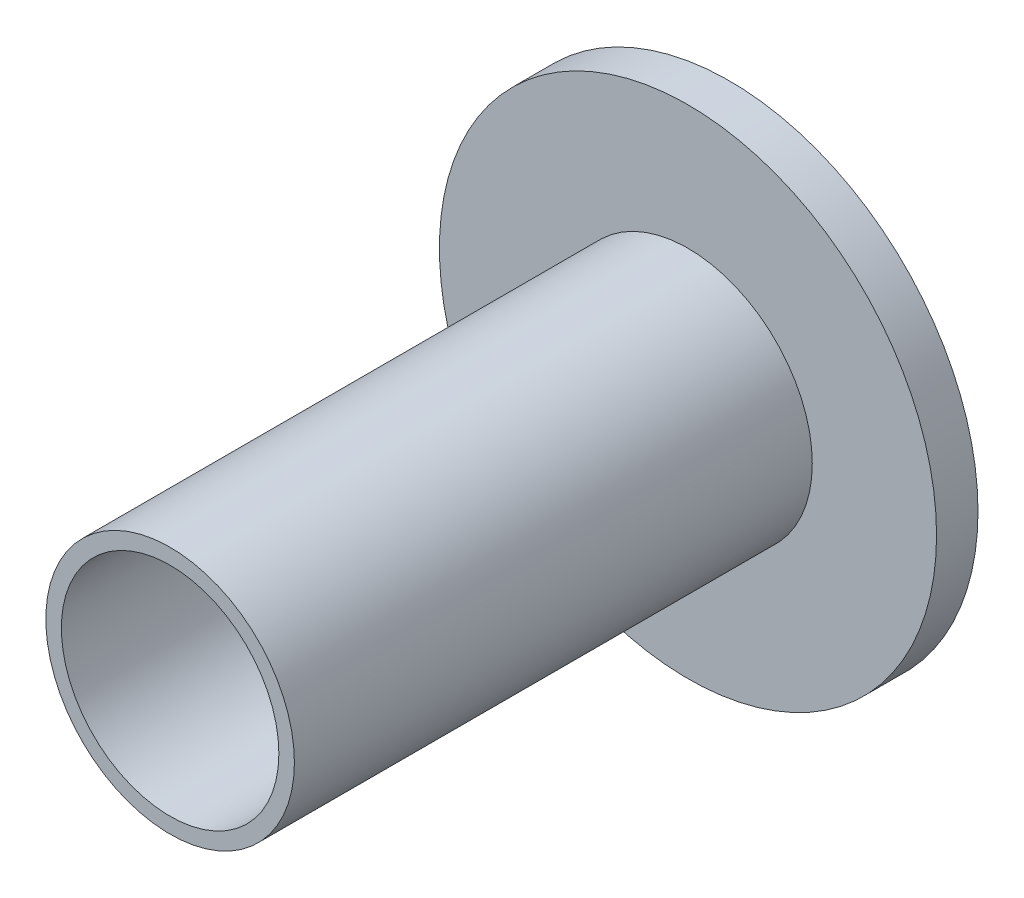
ISO-10303-21;
HEADER;
FILE_DESCRIPTION(('STEP AP214'),'2;1');
FILE_NAME('part.step','',(''),(''),'','','');
FILE_SCHEMA(('AUTOMOTIVE_DESIGN { 1 0 10303 214 1 1 1 1 }'));
ENDSEC;
DATA;
#1=APPLICATION_CONTEXT('core data for automotive mechanical design processes');
#2=APPLICATION_PROTOCOL_DEFINITION('international standard','automotive_design',2000,#1);
#3=PRODUCT_CONTEXT('',#1,'mechanical');
#4=PRODUCT('Part','Part','',(#3));
#5=PRODUCT_RELATED_PRODUCT_CATEGORY('part','',(#4));
#6=PRODUCT_DEFINITION_FORMATION('','',#4);
#7=PRODUCT_DEFINITION_CONTEXT('part definition',#1,'design');
#8=PRODUCT_DEFINITION('design','',#6,#7);
#9=PRODUCT_DEFINITION_SHAPE('','',#8);
#10=(LENGTH_UNIT() NAMED_UNIT(*) SI_UNIT(.MILLI.,.METRE.));
#11=(NAMED_UNIT(*) PLANE_ANGLE_UNIT() SI_UNIT($,.RADIAN.));
#12=(NAMED_UNIT(*) SI_UNIT($,.STERADIAN.) SOLID_ANGLE_UNIT());
#13=UNCERTAINTY_MEASURE_WITH_UNIT(LENGTH_MEASURE(1.E-05),#10,'distance_accuracy_value','');
#14=(GEOMETRIC_REPRESENTATION_CONTEXT(3) GLOBAL_UNCERTAINTY_ASSIGNED_CONTEXT((#13)) GLOBAL_UNIT_ASSIGNED_CONTEXT((#10,
#11,#12)) REPRESENTATION_CONTEXT('',''));
#15=CARTESIAN_POINT('',(0.,0.,0.));
#16=DIRECTION('',(0.,0.,1.));
#17=DIRECTION('',(1.,0.,0.));
#18=AXIS2_PLACEMENT_3D('',#15,#16,#17);
#19=CARTESIAN_POINT('',(0.,0.,2.));
#20=DIRECTION('',(0.,0.,-1.));
#21=DIRECTION('',(-1.,0.,0.));
#22=AXIS2_PLACEMENT_3D('',#19,#20,#21);
#23=CYLINDRICAL_SURFACE('',#22,12.);
#24=CARTESIAN_POINT('',(0.,0.,2.));
#25=DIRECTION('',(0.,0.,1.));
#26=DIRECTION('',(1.,0.,0.));
#27=AXIS2_PLACEMENT_3D('',#24,#25,#26);
#28=CIRCLE('',#27,12.);
#29=CARTESIAN_POINT('',(12.,0.,2.));
#30=VERTEX_POINT('',#29);
#31=EDGE_CURVE('E38',#30,#30,#28,.T.);
#32=ORIENTED_EDGE('',*,*,#31,.F.);
#33=EDGE_LOOP('',(#32));
#34=FACE_BOUND('',#33,.T.);
#35=CARTESIAN_POINT('',(0.,0.,0.));
#36=DIRECTION('',(0.,0.,1.));
#37=DIRECTION('',(1.,0.,0.));
#38=AXIS2_PLACEMENT_3D('',#35,#36,#37);
#39=CIRCLE('',#38,12.);
#40=CARTESIAN_POINT('',(12.,0.,0.));
#41=VERTEX_POINT('',#40);
#42=EDGE_CURVE('E34',#41,#41,#39,.T.);
#43=ORIENTED_EDGE('',*,*,#42,.T.);
#44=EDGE_LOOP('',(#43));
#45=FACE_BOUND('',#44,.T.);
#46=ADVANCED_FACE('F31',(#34,#45),#23,.T.);
#47=CARTESIAN_POINT('',(0.,0.,2.));
#48=DIRECTION('',(0.,0.,1.));
#49=DIRECTION('',(1.,0.,0.));
#50=AXIS2_PLACEMENT_3D('',#47,#48,#49);
#51=PLANE('',#50);
#52=CARTESIAN_POINT('',(0.,0.,2.));
#53=DIRECTION('',(0.,0.,1.));
#54=DIRECTION('',(1.,0.,0.));
#55=AXIS2_PLACEMENT_3D('',#52,#53,#54);
#56=CIRCLE('',#55,6.);
#57=CARTESIAN_POINT('',(6.,0.,2.));
#58=VERTEX_POINT('',#57);
#59=EDGE_CURVE('E10',#58,#58,#56,.T.);
#60=ORIENTED_EDGE('',*,*,#59,.F.);
#61=EDGE_LOOP('',(#60));
#62=FACE_BOUND('',#61,.T.);
#63=ORIENTED_EDGE('',*,*,#31,.T.);
#64=EDGE_LOOP('',(#63));
#65=FACE_BOUND('',#64,.T.);
#66=ADVANCED_FACE('F70',(#62,#65),#51,.T.);
#67=CARTESIAN_POINT('',(0.,0.,0.));
#68=DIRECTION('',(0.,0.,1.));
#69=DIRECTION('',(1.,0.,0.));
#70=AXIS2_PLACEMENT_3D('',#67,#68,#69);
#71=PLANE('',#70);
#72=CARTESIAN_POINT('',(0.,0.,0.));
#73=DIRECTION('',(0.,0.,1.));
#74=DIRECTION('',(1.,0.,0.));
#75=AXIS2_PLACEMENT_3D('',#72,#73,#74);
#76=CIRCLE('',#75,5.25);
#77=CARTESIAN_POINT('',(5.25,0.,0.));
#78=VERTEX_POINT('',#77);
#79=EDGE_CURVE('E47',#78,#78,#76,.T.);
#80=ORIENTED_EDGE('',*,*,#79,.T.);
#81=EDGE_LOOP('',(#80));
#82=FACE_BOUND('',#81,.T.);
#83=ORIENTED_EDGE('',*,*,#42,.F.);
#84=EDGE_LOOP('',(#83));
#85=FACE_BOUND('',#84,.T.);
#86=ADVANCED_FACE('F65',(#82,#85),#71,.F.);
#87=CARTESIAN_POINT('',(0.,0.,27.));
#88=DIRECTION('',(0.,0.,-1.));
#89=DIRECTION('',(-1.,0.,0.));
#90=AXIS2_PLACEMENT_3D('',#87,#88,#89);
#91=CYLINDRICAL_SURFACE('',#90,6.);
#92=CARTESIAN_POINT('',(0.,0.,27.));
#93=DIRECTION('',(0.,0.,1.));
#94=DIRECTION('',(1.,0.,0.));
#95=AXIS2_PLACEMENT_3D('',#92,#93,#94);
#96=CIRCLE('',#95,6.);
#97=CARTESIAN_POINT('',(6.,0.,27.));
#98=VERTEX_POINT('',#97);
#99=EDGE_CURVE('E44',#98,#98,#96,.T.);
#100=ORIENTED_EDGE('',*,*,#99,.F.);
#101=EDGE_LOOP('',(#100));
#102=FACE_BOUND('',#101,.T.);
#103=ORIENTED_EDGE('',*,*,#59,.T.);
#104=EDGE_LOOP('',(#103));
#105=FACE_BOUND('',#104,.T.);
#106=ADVANCED_FACE('F60',(#102,#105),#91,.T.);
#107=CARTESIAN_POINT('',(0.,0.,27.));
#108=DIRECTION('',(0.,0.,1.));
#109=DIRECTION('',(1.,0.,0.));
#110=AXIS2_PLACEMENT_3D('',#107,#108,#109);
#111=PLANE('',#110);
#112=CARTESIAN_POINT('',(0.,0.,27.));
#113=DIRECTION('',(0.,0.,1.));
#114=DIRECTION('',(1.,0.,0.));
#115=AXIS2_PLACEMENT_3D('',#112,#113,#114);
#116=CIRCLE('',#115,5.25);
#117=CARTESIAN_POINT('',(5.25,0.,27.));
#118=VERTEX_POINT('',#117);
#119=EDGE_CURVE('E50',#118,#118,#116,.T.);
#120=ORIENTED_EDGE('',*,*,#119,.F.);
#121=EDGE_LOOP('',(#120));
#122=FACE_BOUND('',#121,.T.);
#123=ORIENTED_EDGE('',*,*,#99,.T.);
#124=EDGE_LOOP('',(#123));
#125=FACE_BOUND('',#124,.T.);
#126=ADVANCED_FACE('F57',(#122,#125),#111,.T.);
#127=CARTESIAN_POINT('',(0.,0.,-10.));
#128=DIRECTION('',(0.,0.,1.));
#129=DIRECTION('',(1.,0.,0.));
#130=AXIS2_PLACEMENT_3D('',#127,#128,#129);
#131=CYLINDRICAL_SURFACE('',#130,5.25);
#132=ORIENTED_EDGE('',*,*,#119,.T.);
#133=EDGE_LOOP('',(#132));
#134=FACE_BOUND('',#133,.T.);
#135=ORIENTED_EDGE('',*,*,#79,.F.);
#136=EDGE_LOOP('',(#135));
#137=FACE_BOUND('',#136,.T.);
#138=ADVANCED_FACE('F54',(#134,#137),#131,.F.);
#139=CLOSED_SHELL('',(#46,#66,#86,#106,#126,#138));
#140=MANIFOLD_SOLID_BREP('B2',#139);
#141=ADVANCED_BREP_SHAPE_REPRESENTATION('',(#18,#140),#14);
#142=SHAPE_DEFINITION_REPRESENTATION(#9,#141);
ENDSEC;
END-ISO-10303-21;
